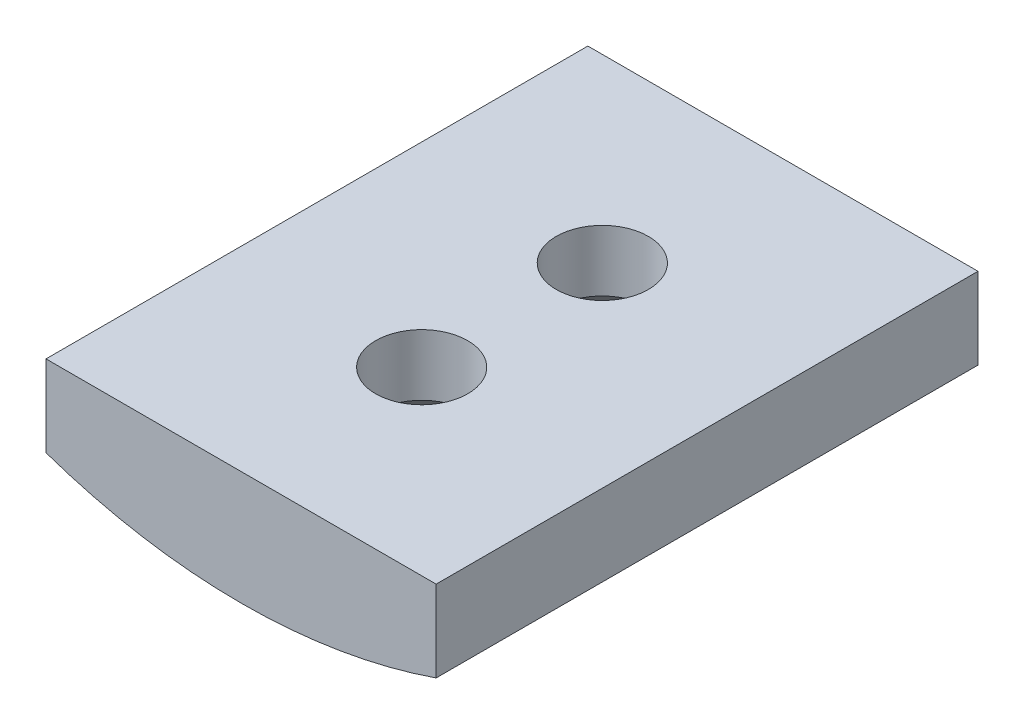
ISO-10303-21;
HEADER;
FILE_DESCRIPTION(('STEP AP214'),'2;1');
FILE_NAME('part.step','',(''),(''),'','','');
FILE_SCHEMA(('AUTOMOTIVE_DESIGN { 1 0 10303 214 1 1 1 1 }'));
ENDSEC;
DATA;
#1=APPLICATION_CONTEXT('core data for automotive mechanical design processes');
#2=APPLICATION_PROTOCOL_DEFINITION('international standard','automotive_design',2000,#1);
#3=PRODUCT_CONTEXT('',#1,'mechanical');
#4=PRODUCT('Part','Part','',(#3));
#5=PRODUCT_RELATED_PRODUCT_CATEGORY('part','',(#4));
#6=PRODUCT_DEFINITION_FORMATION('','',#4);
#7=PRODUCT_DEFINITION_CONTEXT('part definition',#1,'design');
#8=PRODUCT_DEFINITION('design','',#6,#7);
#9=PRODUCT_DEFINITION_SHAPE('','',#8);
#10=(LENGTH_UNIT() NAMED_UNIT(*) SI_UNIT(.MILLI.,.METRE.));
#11=(NAMED_UNIT(*) PLANE_ANGLE_UNIT() SI_UNIT($,.RADIAN.));
#12=(NAMED_UNIT(*) SI_UNIT($,.STERADIAN.) SOLID_ANGLE_UNIT());
#13=UNCERTAINTY_MEASURE_WITH_UNIT(LENGTH_MEASURE(1.E-05),#10,'distance_accuracy_value','');
#14=(GEOMETRIC_REPRESENTATION_CONTEXT(3) GLOBAL_UNCERTAINTY_ASSIGNED_CONTEXT((#13)) GLOBAL_UNIT_ASSIGNED_CONTEXT((#10,
#11,#12)) REPRESENTATION_CONTEXT('',''));
#15=CARTESIAN_POINT('',(0.,0.,0.));
#16=DIRECTION('',(0.,0.,1.));
#17=DIRECTION('',(1.,0.,0.));
#18=AXIS2_PLACEMENT_3D('',#15,#16,#17);
#19=CARTESIAN_POINT('',(7.2,0.,-20.));
#20=DIRECTION('',(1.,0.,0.));
#21=DIRECTION('',(0.,0.,-1.));
#22=AXIS2_PLACEMENT_3D('',#19,#20,#21);
#23=PLANE('',#22);
#24=DIRECTION('',(0.,1.,0.));
#25=VECTOR('',#24,1.);
#26=CARTESIAN_POINT('',(7.2,0.,0.));
#27=LINE('',#26,#25);
#28=CARTESIAN_POINT('',(7.2,-15.4,0.));
#29=VERTEX_POINT('',#28);
#30=CARTESIAN_POINT('',(7.2,-12.4,0.));
#31=VERTEX_POINT('',#30);
#32=EDGE_CURVE('E113',#29,#31,#27,.T.);
#33=ORIENTED_EDGE('',*,*,#32,.F.);
#34=DIRECTION('',(0.,0.,1.));
#35=VECTOR('',#34,1.);
#36=CARTESIAN_POINT('',(7.2,-15.4,-20.));
#37=LINE('',#36,#35);
#38=CARTESIAN_POINT('',(7.2,-15.4,-20.));
#39=VERTEX_POINT('',#38);
#40=EDGE_CURVE('E61',#39,#29,#37,.T.);
#41=ORIENTED_EDGE('',*,*,#40,.F.);
#42=DIRECTION('',(0.,1.,0.));
#43=VECTOR('',#42,1.);
#44=CARTESIAN_POINT('',(7.2,0.,-20.));
#45=LINE('',#44,#43);
#46=CARTESIAN_POINT('',(7.2,-12.4,-20.));
#47=VERTEX_POINT('',#46);
#48=EDGE_CURVE('E106',#39,#47,#45,.T.);
#49=ORIENTED_EDGE('',*,*,#48,.T.);
#50=DIRECTION('',(0.,0.,1.));
#51=VECTOR('',#50,1.);
#52=CARTESIAN_POINT('',(7.2,-12.4,-20.));
#53=LINE('',#52,#51);
#54=EDGE_CURVE('E89',#47,#31,#53,.T.);
#55=ORIENTED_EDGE('',*,*,#54,.T.);
#56=EDGE_LOOP('',(#33,#41,#49,#55));
#57=FACE_BOUND('',#56,.T.);
#58=ADVANCED_FACE('F40',(#57),#23,.T.);
#59=CARTESIAN_POINT('',(0.,5.45458957280147,-20.));
#60=DIRECTION('',(0.,0.,1.));
#61=DIRECTION('',(1.,0.,0.));
#62=AXIS2_PLACEMENT_3D('',#59,#60,#61);
#63=CYLINDRICAL_SURFACE('',#62,22.0625);
#64=CARTESIAN_POINT('',(3.15,-16.3818800651689,-13.3333333333333));
#65=CARTESIAN_POINT('',(3.1499926615335,-16.3818828935208,-13.1573666601596));
#66=CARTESIAN_POINT('',(3.13520528078202,-16.3840300759794,-12.9812954267399));
#67=CARTESIAN_POINT('',(3.07645819594805,-16.3923817871647,-12.6340687412061));
#68=CARTESIAN_POINT('',(3.03246941397847,-16.3985903600131,-12.4629183665483));
#69=CARTESIAN_POINT('',(2.9166563937715,-16.4143476338234,-12.1306100618841));
#70=CARTESIAN_POINT('',(2.84485275731884,-16.4238938621564,-11.9694448383609));
#71=CARTESIAN_POINT('',(2.67549551492006,-16.4452478824637,-11.6614756347439));
#72=CARTESIAN_POINT('',(2.57794571601529,-16.4570553400031,-11.5146695357861));
#73=CARTESIAN_POINT('',(2.35910786508147,-16.481697358379,-11.2384944528059));
#74=CARTESIAN_POINT('',(2.23766976590573,-16.4945380914667,-11.109244900656));
#75=CARTESIAN_POINT('',(1.9748262789637,-16.5197446266066,-10.8728858154427));
#76=CARTESIAN_POINT('',(1.83341982695304,-16.5321104033007,-10.7657774631791));
#77=CARTESIAN_POINT('',(1.53389253151385,-16.5550379410216,-10.5763039573934));
#78=CARTESIAN_POINT('',(1.37570178210913,-16.5655916361255,-10.4940482548667));
#79=CARTESIAN_POINT('',(1.04757468465851,-16.5836376799403,-10.3573169436052));
#80=CARTESIAN_POINT('',(0.877638900646125,-16.5911301755405,-10.3028400018981));
#81=CARTESIAN_POINT('',(0.532073437591138,-16.6021660936374,-10.2235732015948));
#82=CARTESIAN_POINT('',(0.356490412595248,-16.6057360607264,-10.1985837088388));
#83=CARTESIAN_POINT('',(0.0035893961119035,-16.6086155627789,-10.1783816507968));
#84=CARTESIAN_POINT('',(-0.173728507120744,-16.6079253133499,-10.1831675785913));
#85=CARTESIAN_POINT('',(-0.523705015637894,-16.602383445012,-10.2222222143901));
#86=CARTESIAN_POINT('',(-0.696388133389431,-16.5975621380731,-10.2562761714191));
#87=CARTESIAN_POINT('',(-1.03356346319494,-16.5843336916298,-10.3525635355542));
#88=CARTESIAN_POINT('',(-1.19805548069303,-16.5759264669977,-10.4147976116434));
#89=CARTESIAN_POINT('',(-1.51483383770857,-16.5564186234851,-10.5659010704175));
#90=CARTESIAN_POINT('',(-1.66707609491637,-16.545308809527,-10.654861633348));
#91=CARTESIAN_POINT('',(-1.95455259581068,-16.5216354602123,-10.8568263110571));
#92=CARTESIAN_POINT('',(-2.08978582308062,-16.5090718380658,-10.9698318616182));
#93=CARTESIAN_POINT('',(-2.34067011421858,-16.4837613511438,-11.2178770469077));
#94=CARTESIAN_POINT('',(-2.45613591360314,-16.4710138511737,-11.3531040809103));
#95=CARTESIAN_POINT('',(-2.66276310676184,-16.4468819437701,-11.6411147890806));
#96=CARTESIAN_POINT('',(-2.75392437627795,-16.4354975433058,-11.7938985530022));
#97=CARTESIAN_POINT('',(-2.90937533450732,-16.4153811427442,-12.1128702177329));
#98=CARTESIAN_POINT('',(-2.97364727607329,-16.4066508954423,-12.2790668851191));
#99=CARTESIAN_POINT('',(-3.07331557618337,-16.3928632054933,-12.6200477274304));
#100=CARTESIAN_POINT('',(-3.10871376972835,-16.387805529447,-12.7948313558835));
#101=CARTESIAN_POINT('',(-3.14937835779442,-16.3819794591579,-13.1463800470267));
#102=CARTESIAN_POINT('',(-3.15490679142086,-16.381173764918,-13.3231142028637));
#103=CARTESIAN_POINT('',(-3.13636903747217,-16.3838439740906,-13.6749863861285));
#104=CARTESIAN_POINT('',(-3.11230367911583,-16.387319757536,-13.8501244581402));
#105=CARTESIAN_POINT('',(-3.03548322562295,-16.398127098035,-14.1930293211403));
#106=CARTESIAN_POINT('',(-2.98285755131242,-16.4054412566249,-14.3608257021973));
#107=CARTESIAN_POINT('',(-2.85054450765458,-16.4230869617301,-14.6852149196855));
#108=CARTESIAN_POINT('',(-2.77085591832285,-16.4334186442712,-14.8418072506577));
#109=CARTESIAN_POINT('',(-2.58604503054297,-16.456023617457,-15.1405212898159));
#110=CARTESIAN_POINT('',(-2.48075242519724,-16.4683097104008,-15.2825366458558));
#111=CARTESIAN_POINT('',(-2.24796034810074,-16.4934001311382,-15.5469746621531));
#112=CARTESIAN_POINT('',(-2.12045974210801,-16.5062044853756,-15.6693963210774));
#113=CARTESIAN_POINT('',(-1.84571976158441,-16.5310046808898,-15.8921065892459));
#114=CARTESIAN_POINT('',(-1.69833927560974,-16.5429937244544,-15.9922219881573));
#115=CARTESIAN_POINT('',(-1.38870056952476,-16.5647080962977,-16.1662736083545));
#116=CARTESIAN_POINT('',(-1.22644272483405,-16.5744334816764,-16.2402104900078));
#117=CARTESIAN_POINT('',(-0.892206618222844,-16.5904948560094,-16.3595266581187));
#118=CARTESIAN_POINT('',(-0.720263324916976,-16.5968422698396,-16.4050022984199));
#119=CARTESIAN_POINT('',(-0.371084011993663,-16.6054803272357,-16.4664174649228));
#120=CARTESIAN_POINT('',(-0.193848308341552,-16.6077712124924,-16.4823587508045));
#121=CARTESIAN_POINT('',(0.159201399215112,-16.6080360665732,-16.4842128382914));
#122=CARTESIAN_POINT('',(0.335014037583778,-16.6060482246507,-16.4703912839983));
#123=CARTESIAN_POINT('',(0.681788752759662,-16.5980556302985,-16.4136793494021));
#124=CARTESIAN_POINT('',(0.852750840974787,-16.5920508873168,-16.3707890374712));
#125=CARTESIAN_POINT('',(1.1849101104499,-16.5766959939182,-16.2572480970433));
#126=CARTESIAN_POINT('',(1.34611309131084,-16.56734785368,-16.1866141465863));
#127=CARTESIAN_POINT('',(1.65442083179553,-16.546335483637,-16.0196189450328));
#128=CARTESIAN_POINT('',(1.80152522094758,-16.5346711929948,-15.9232570181287));
#129=CARTESIAN_POINT('',(2.07881068191738,-16.510200899173,-15.706573509054));
#130=CARTESIAN_POINT('',(2.20883728545014,-16.4973860345802,-15.5860552413913));
#131=CARTESIAN_POINT('',(2.44691946230842,-16.4721261645448,-15.3248933558101));
#132=CARTESIAN_POINT('',(2.55496986114982,-16.4596812467969,-15.1842450113452));
#133=CARTESIAN_POINT('',(2.74651764038748,-16.4365029300195,-14.8859831966027));
#134=CARTESIAN_POINT('',(2.82988796998625,-16.4257785132084,-14.72828745599));
#135=CARTESIAN_POINT('',(2.96883737310256,-16.4073606301906,-14.4010575291551));
#136=CARTESIAN_POINT('',(3.02444571551023,-16.3996639737022,-14.2315360264833));
#137=CARTESIAN_POINT('',(3.09345777676682,-16.3899793474276,-13.939902132076));
#138=CARTESIAN_POINT('',(3.11462927818026,-16.3869579150078,-13.8196035974595));
#139=CARTESIAN_POINT('',(3.14290285578349,-16.3829073043258,-13.5773312339388));
#140=CARTESIAN_POINT('',(3.15000508885963,-16.3818781038482,-13.4553574237309));
#141=CARTESIAN_POINT('',(3.15,-16.3818800651689,-13.3333333333333));
#142=B_SPLINE_CURVE_WITH_KNOTS('',3,(#64,#65,#66,#67,#68,#69,#70,#71,#72,#73,#74,#75,#76,#77,
#78,#79,#80,#81,#82,#83,#84,#85,#86,#87,#88,#89,#90,#91,#92,#93,#94,#95,#96,#97,#98,#99,#100,
#101,#102,#103,#104,#105,#106,#107,#108,#109,#110,#111,#112,#113,#114,#115,#116,#117,#118,#119,
#120,#121,#122,#123,#124,#125,#126,#127,#128,#129,#130,#131,#132,#133,#134,#135,#136,#137,#138,
#139,#140,#141),.UNSPECIFIED.,.T.,.F.,(4,2,2,2,2,2,2,2,2,2,2,2,2,2,2,2,2,2,2,2,2,2,2,2,2,2,2,2,
2,2,2,2,2,2,2,2,2,2,4),(0.,0.527454084039141,1.05543418060091,1.58302396060528,2.11053577046952,
2.64147335481299,3.17243924698673,3.70571052515762,4.23895621173451,4.7685706508212,
5.298158286599,5.82389298504149,6.34964016483893,6.87720175779943,7.40479486154192,
7.93709005528285,8.46938797035542,9.00203665369977,9.53465148321361,10.0625861516733,
10.5905060277278,11.1160533748039,11.641624416471,12.1707918452549,12.6999863084391,
13.2331569323469,13.766314105773,14.2976564024444,14.8289670403077,15.3555552063164,
15.8821421337507,16.4084129876709,16.9346976667331,17.4654555432717,17.9963382469533,
18.5299081702397,19.0629143675234,19.428681483444,19.7944445206745),.UNSPECIFIED.);
#143=CARTESIAN_POINT('',(3.15,-16.3818800651689,-13.3333333333333));
#144=VERTEX_POINT('',#143);
#145=EDGE_CURVE('E11',#144,#144,#142,.T.);
#146=ORIENTED_EDGE('',*,*,#145,.F.);
#147=EDGE_LOOP('',(#146));
#148=FACE_BOUND('',#147,.T.);
#149=CARTESIAN_POINT('',(3.15,-16.3818800651689,-6.66666666666667));
#150=CARTESIAN_POINT('',(3.1499926615335,-16.3818828935208,-6.49069999349292));
#151=CARTESIAN_POINT('',(3.13520528078202,-16.3840300759794,-6.31462876007321));
#152=CARTESIAN_POINT('',(3.07645819594805,-16.3923817871647,-5.9674020745394));
#153=CARTESIAN_POINT('',(3.03246941397847,-16.3985903600131,-5.79625169988163));
#154=CARTESIAN_POINT('',(2.9166563937715,-16.4143476338234,-5.4639433952174));
#155=CARTESIAN_POINT('',(2.84485275731884,-16.4238938621564,-5.30277817169419));
#156=CARTESIAN_POINT('',(2.67549551492006,-16.4452478824637,-4.99480896807727));
#157=CARTESIAN_POINT('',(2.57794571601529,-16.4570553400031,-4.84800286911941));
#158=CARTESIAN_POINT('',(2.35910786508147,-16.481697358379,-4.57182778613927));
#159=CARTESIAN_POINT('',(2.23766976590573,-16.4945380914667,-4.44257823398935));
#160=CARTESIAN_POINT('',(1.9748262789637,-16.5197446266066,-4.20621914877607));
#161=CARTESIAN_POINT('',(1.83341982695304,-16.5321104033007,-4.09911079651247));
#162=CARTESIAN_POINT('',(1.53389253151384,-16.5550379410216,-3.90963729072676));
#163=CARTESIAN_POINT('',(1.37570178210912,-16.5655916361255,-3.82738158820006));
#164=CARTESIAN_POINT('',(1.04757468465851,-16.5836376799403,-3.69065027693855));
#165=CARTESIAN_POINT('',(0.877638900646123,-16.5911301755405,-3.6361733352314));
#166=CARTESIAN_POINT('',(0.532073437591136,-16.6021660936374,-3.55690653492812));
#167=CARTESIAN_POINT('',(0.356490412595246,-16.6057360607264,-3.53191704217214));
#168=CARTESIAN_POINT('',(0.00358939611190193,-16.6086155627789,-3.51171498413013));
#169=CARTESIAN_POINT('',(-0.173728507120746,-16.6079253133499,-3.51650091192466));
#170=CARTESIAN_POINT('',(-0.523705015637896,-16.602383445012,-3.55555554772342));
#171=CARTESIAN_POINT('',(-0.696388133389433,-16.5975621380731,-3.5896095047524));
#172=CARTESIAN_POINT('',(-1.03356346319494,-16.5843336916298,-3.6858968688875));
#173=CARTESIAN_POINT('',(-1.19805548069304,-16.5759264669977,-3.74813094497672));
#174=CARTESIAN_POINT('',(-1.51483383770857,-16.5564186234851,-3.89923440375086));
#175=CARTESIAN_POINT('',(-1.66707609491637,-16.545308809527,-3.98819496668129));
#176=CARTESIAN_POINT('',(-1.95455259581068,-16.5216354602123,-4.19015964439038));
#177=CARTESIAN_POINT('',(-2.08978582308062,-16.5090718380658,-4.30316519495151));
#178=CARTESIAN_POINT('',(-2.34067011421858,-16.4837613511438,-4.55121038024106));
#179=CARTESIAN_POINT('',(-2.45613591360314,-16.4710138511737,-4.68643741424366));
#180=CARTESIAN_POINT('',(-2.66276310676184,-16.4468819437701,-4.97444812241393));
#181=CARTESIAN_POINT('',(-2.75392437627795,-16.4354975433058,-5.12723188633549));
#182=CARTESIAN_POINT('',(-2.90937533450732,-16.4153811427442,-5.44620355106628));
#183=CARTESIAN_POINT('',(-2.97364727607329,-16.4066508954423,-5.61240021845244));
#184=CARTESIAN_POINT('',(-3.07331557618337,-16.3928632054933,-5.95338106076377));
#185=CARTESIAN_POINT('',(-3.10871376972835,-16.387805529447,-6.12816468921688));
#186=CARTESIAN_POINT('',(-3.14937835779442,-16.3819794591579,-6.47971338036006));
#187=CARTESIAN_POINT('',(-3.15490679142086,-16.381173764918,-6.656447536197));
#188=CARTESIAN_POINT('',(-3.13636903747217,-16.3838439740906,-7.00831971946183));
#189=CARTESIAN_POINT('',(-3.11230367911583,-16.387319757536,-7.1834577914735));
#190=CARTESIAN_POINT('',(-3.03548322562295,-16.398127098035,-7.52636265447359));
#191=CARTESIAN_POINT('',(-2.98285755131242,-16.4054412566249,-7.69415903553065));
#192=CARTESIAN_POINT('',(-2.85054450765458,-16.4230869617301,-8.01854825301888));
#193=CARTESIAN_POINT('',(-2.77085591832285,-16.4334186442712,-8.17514058399099));
#194=CARTESIAN_POINT('',(-2.58604503054297,-16.456023617457,-8.47385462314928));
#195=CARTESIAN_POINT('',(-2.48075242519725,-16.4683097104008,-8.61586997918913));
#196=CARTESIAN_POINT('',(-2.24796034810074,-16.4934001311382,-8.88030799548648));
#197=CARTESIAN_POINT('',(-2.12045974210801,-16.5062044853756,-9.00272965441076));
#198=CARTESIAN_POINT('',(-1.84571976158441,-16.5310046808898,-9.22543992257924));
#199=CARTESIAN_POINT('',(-1.69833927560974,-16.5429937244544,-9.32555532149061));
#200=CARTESIAN_POINT('',(-1.38870056952476,-16.5647080962977,-9.49960694168779));
#201=CARTESIAN_POINT('',(-1.22644272483405,-16.5744334816764,-9.57354382334116));
#202=CARTESIAN_POINT('',(-0.892206618222844,-16.5904948560094,-9.692859991452));
#203=CARTESIAN_POINT('',(-0.720263324916976,-16.5968422698396,-9.73833563175322));
#204=CARTESIAN_POINT('',(-0.371084011993663,-16.6054803272357,-9.79975079825614));
#205=CARTESIAN_POINT('',(-0.193848308341552,-16.6077712124924,-9.81569208413779));
#206=CARTESIAN_POINT('',(0.159201399215111,-16.6080360665732,-9.81754617162473));
#207=CARTESIAN_POINT('',(0.335014037583778,-16.6060482246507,-9.80372461733161));
#208=CARTESIAN_POINT('',(0.681788752759661,-16.5980556302985,-9.74701268273548));
#209=CARTESIAN_POINT('',(0.852750840974787,-16.5920508873168,-9.70412237080456));
#210=CARTESIAN_POINT('',(1.18491011044989,-16.5766959939182,-9.59058143037663));
#211=CARTESIAN_POINT('',(1.34611309131084,-16.56734785368,-9.51994747991959));
#212=CARTESIAN_POINT('',(1.65442083179552,-16.546335483637,-9.35295227836618));
#213=CARTESIAN_POINT('',(1.80152522094757,-16.5346711929948,-9.25659035146205));
#214=CARTESIAN_POINT('',(2.07881068191738,-16.510200899173,-9.03990684238738));
#215=CARTESIAN_POINT('',(2.20883728545014,-16.4973860345802,-8.91938857472461));
#216=CARTESIAN_POINT('',(2.44691946230842,-16.4721261645448,-8.65822668914347));
#217=CARTESIAN_POINT('',(2.55496986114982,-16.4596812467969,-8.51757834467849));
#218=CARTESIAN_POINT('',(2.74651764038748,-16.4365029300195,-8.21931652993603));
#219=CARTESIAN_POINT('',(2.82988796998625,-16.4257785132084,-8.06162078932332));
#220=CARTESIAN_POINT('',(2.96883737310256,-16.4073606301906,-7.73439086248839));
#221=CARTESIAN_POINT('',(3.02444571551023,-16.3996639737022,-7.56486935981667));
#222=CARTESIAN_POINT('',(3.09345777676682,-16.3899793474276,-7.27323546540938));
#223=CARTESIAN_POINT('',(3.11462927818026,-16.3869579150078,-7.15293693079285));
#224=CARTESIAN_POINT('',(3.14290285578349,-16.3829073043258,-6.91066456727217));
#225=CARTESIAN_POINT('',(3.15000508885963,-16.3818781038482,-6.78869075706426));
#226=CARTESIAN_POINT('',(3.15,-16.3818800651689,-6.66666666666667));
#227=B_SPLINE_CURVE_WITH_KNOTS('',3,(#149,#150,#151,#152,#153,#154,#155,#156,#157,#158,#159,
#160,#161,#162,#163,#164,#165,#166,#167,#168,#169,#170,#171,#172,#173,#174,#175,#176,#177,#178,
#179,#180,#181,#182,#183,#184,#185,#186,#187,#188,#189,#190,#191,#192,#193,#194,#195,#196,#197,
#198,#199,#200,#201,#202,#203,#204,#205,#206,#207,#208,#209,#210,#211,#212,#213,#214,#215,#216,
#217,#218,#219,#220,#221,#222,#223,#224,#225,#226),.UNSPECIFIED.,.T.,.F.,(4,2,2,2,2,2,2,2,2,2,2,
2,2,2,2,2,2,2,2,2,2,2,2,2,2,2,2,2,2,2,2,2,2,2,2,2,2,2,4),(0.,0.527454084039142,1.05543418060092,
1.58302396060527,2.11053577046952,2.64147335481299,3.17243924698673,3.70571052515762,
4.23895621173451,4.7685706508212,5.298158286599,5.82389298504149,6.34964016483893,
6.87720175779942,7.40479486154192,7.93709005528285,8.46938797035542,9.00203665369976,
9.53465148321361,10.0625861516733,10.5905060277278,11.1160533748039,11.641624416471,
12.1707918452549,12.6999863084391,13.2331569323468,13.766314105773,14.2976564024444,
14.8289670403077,15.3555552063164,15.8821421337507,16.4084129876709,16.9346976667331,
17.4654555432717,17.9963382469533,18.5299081702397,19.0629143675234,19.428681483444,
19.7944445206745),.UNSPECIFIED.);
#228=CARTESIAN_POINT('',(3.15,-16.3818800651689,-6.66666666666667));
#229=VERTEX_POINT('',#228);
#230=EDGE_CURVE('E53',#229,#229,#227,.T.);
#231=ORIENTED_EDGE('',*,*,#230,.F.);
#232=EDGE_LOOP('',(#231));
#233=FACE_BOUND('',#232,.T.);
#234=CARTESIAN_POINT('',(0.,5.45458957280147,0.));
#235=DIRECTION('',(0.,0.,1.));
#236=DIRECTION('',(1.,0.,0.));
#237=AXIS2_PLACEMENT_3D('',#234,#235,#236);
#238=CIRCLE('',#237,22.0625);
#239=CARTESIAN_POINT('',(-7.2,-15.4,0.));
#240=VERTEX_POINT('',#239);
#241=EDGE_CURVE('E108',#240,#29,#238,.T.);
#242=ORIENTED_EDGE('',*,*,#241,.F.);
#243=DIRECTION('',(0.,0.,1.));
#244=VECTOR('',#243,1.);
#245=CARTESIAN_POINT('',(-7.2,-15.4,-20.));
#246=LINE('',#245,#244);
#247=CARTESIAN_POINT('',(-7.2,-15.4,-20.));
#248=VERTEX_POINT('',#247);
#249=EDGE_CURVE('E78',#248,#240,#246,.T.);
#250=ORIENTED_EDGE('',*,*,#249,.F.);
#251=CARTESIAN_POINT('',(0.,5.45458957280147,-20.));
#252=DIRECTION('',(0.,0.,1.));
#253=DIRECTION('',(1.,0.,0.));
#254=AXIS2_PLACEMENT_3D('',#251,#252,#253);
#255=CIRCLE('',#254,22.0625);
#256=EDGE_CURVE('E98',#248,#39,#255,.T.);
#257=ORIENTED_EDGE('',*,*,#256,.T.);
#258=ORIENTED_EDGE('',*,*,#40,.T.);
#259=EDGE_LOOP('',(#242,#250,#257,#258));
#260=FACE_BOUND('',#259,.T.);
#261=ADVANCED_FACE('F129',(#148,#233,#260),#63,.T.);
#262=CARTESIAN_POINT('',(-7.2,0.,-20.));
#263=DIRECTION('',(1.,0.,0.));
#264=DIRECTION('',(0.,0.,-1.));
#265=AXIS2_PLACEMENT_3D('',#262,#263,#264);
#266=PLANE('',#265);
#267=DIRECTION('',(0.,1.,0.));
#268=VECTOR('',#267,1.);
#269=CARTESIAN_POINT('',(-7.2,0.,0.));
#270=LINE('',#269,#268);
#271=CARTESIAN_POINT('',(-7.2,-12.4,0.));
#272=VERTEX_POINT('',#271);
#273=EDGE_CURVE('E102',#240,#272,#270,.T.);
#274=ORIENTED_EDGE('',*,*,#273,.T.);
#275=DIRECTION('',(0.,0.,1.));
#276=VECTOR('',#275,1.);
#277=CARTESIAN_POINT('',(-7.2,-12.4,-20.));
#278=LINE('',#277,#276);
#279=CARTESIAN_POINT('',(-7.2,-12.4,-20.));
#280=VERTEX_POINT('',#279);
#281=EDGE_CURVE('E100',#280,#272,#278,.T.);
#282=ORIENTED_EDGE('',*,*,#281,.F.);
#283=DIRECTION('',(0.,1.,0.));
#284=VECTOR('',#283,1.);
#285=CARTESIAN_POINT('',(-7.2,0.,-20.));
#286=LINE('',#285,#284);
#287=EDGE_CURVE('E94',#248,#280,#286,.T.);
#288=ORIENTED_EDGE('',*,*,#287,.F.);
#289=ORIENTED_EDGE('',*,*,#249,.T.);
#290=EDGE_LOOP('',(#274,#282,#288,#289));
#291=FACE_BOUND('',#290,.T.);
#292=ADVANCED_FACE('F101',(#291),#266,.F.);
#293=CARTESIAN_POINT('',(0.,-12.4,-20.));
#294=DIRECTION('',(0.,1.,0.));
#295=DIRECTION('',(0.,0.,1.));
#296=AXIS2_PLACEMENT_3D('',#293,#294,#295);
#297=PLANE('',#296);
#298=CARTESIAN_POINT('',(0.,-12.4,-6.66666666666667));
#299=DIRECTION('',(0.,-1.,0.));
#300=DIRECTION('',(0.,0.,-1.));
#301=AXIS2_PLACEMENT_3D('',#298,#299,#300);
#302=CIRCLE('',#301,1.7);
#303=CARTESIAN_POINT('',(0.,-12.4,-8.36666666666667));
#304=VERTEX_POINT('',#303);
#305=EDGE_CURVE('E166',#304,#304,#302,.T.);
#306=ORIENTED_EDGE('',*,*,#305,.T.);
#307=EDGE_LOOP('',(#306));
#308=FACE_BOUND('',#307,.T.);
#309=CARTESIAN_POINT('',(0.,-12.4,-13.3333333333333));
#310=DIRECTION('',(0.,-1.,0.));
#311=DIRECTION('',(0.,0.,-1.));
#312=AXIS2_PLACEMENT_3D('',#309,#310,#311);
#313=CIRCLE('',#312,1.7);
#314=CARTESIAN_POINT('',(0.,-12.4,-15.0333333333333));
#315=VERTEX_POINT('',#314);
#316=EDGE_CURVE('E117',#315,#315,#313,.T.);
#317=ORIENTED_EDGE('',*,*,#316,.T.);
#318=EDGE_LOOP('',(#317));
#319=FACE_BOUND('',#318,.T.);
#320=DIRECTION('',(-1.,0.,0.));
#321=VECTOR('',#320,1.);
#322=CARTESIAN_POINT('',(0.,-12.4,0.));
#323=LINE('',#322,#321);
#324=EDGE_CURVE('E116',#31,#272,#323,.T.);
#325=ORIENTED_EDGE('',*,*,#324,.F.);
#326=ORIENTED_EDGE('',*,*,#54,.F.);
#327=DIRECTION('',(-1.,0.,0.));
#328=VECTOR('',#327,1.);
#329=CARTESIAN_POINT('',(0.,-12.4,-20.));
#330=LINE('',#329,#328);
#331=EDGE_CURVE('E97',#47,#280,#330,.T.);
#332=ORIENTED_EDGE('',*,*,#331,.T.);
#333=ORIENTED_EDGE('',*,*,#281,.T.);
#334=EDGE_LOOP('',(#325,#326,#332,#333));
#335=FACE_BOUND('',#334,.T.);
#336=ADVANCED_FACE('F105',(#308,#319,#335),#297,.T.);
#337=CARTESIAN_POINT('',(0.,0.,-20.));
#338=DIRECTION('',(0.,0.,1.));
#339=DIRECTION('',(1.,0.,0.));
#340=AXIS2_PLACEMENT_3D('',#337,#338,#339);
#341=PLANE('',#340);
#342=ORIENTED_EDGE('',*,*,#48,.F.);
#343=ORIENTED_EDGE('',*,*,#256,.F.);
#344=ORIENTED_EDGE('',*,*,#287,.T.);
#345=ORIENTED_EDGE('',*,*,#331,.F.);
#346=EDGE_LOOP('',(#342,#343,#344,#345));
#347=FACE_BOUND('',#346,.T.);
#348=ADVANCED_FACE('F96',(#347),#341,.F.);
#349=CARTESIAN_POINT('',(0.,0.,0.));
#350=DIRECTION('',(0.,0.,1.));
#351=DIRECTION('',(1.,0.,0.));
#352=AXIS2_PLACEMENT_3D('',#349,#350,#351);
#353=PLANE('',#352);
#354=ORIENTED_EDGE('',*,*,#32,.T.);
#355=ORIENTED_EDGE('',*,*,#324,.T.);
#356=ORIENTED_EDGE('',*,*,#273,.F.);
#357=ORIENTED_EDGE('',*,*,#241,.T.);
#358=EDGE_LOOP('',(#354,#355,#356,#357));
#359=FACE_BOUND('',#358,.T.);
#360=ADVANCED_FACE('F138',(#359),#353,.T.);
#361=CARTESIAN_POINT('',(0.,-16.1079104271985,-6.66666666666667));
#362=DIRECTION('',(0.,-1.,0.));
#363=DIRECTION('',(1.,0.,0.));
#364=AXIS2_PLACEMENT_3D('',#361,#362,#363);
#365=CYLINDRICAL_SURFACE('',#364,3.15);
#366=ORIENTED_EDGE('',*,*,#230,.T.);
#367=EDGE_LOOP('',(#366));
#368=FACE_BOUND('',#367,.T.);
#369=CARTESIAN_POINT('',(0.,-16.1079104271985,-6.66666666666667));
#370=DIRECTION('',(0.,-1.,0.));
#371=DIRECTION('',(0.,0.,-1.));
#372=AXIS2_PLACEMENT_3D('',#369,#370,#371);
#373=CIRCLE('',#372,3.15);
#374=CARTESIAN_POINT('',(0.,-16.1079104271985,-9.81666666666667));
#375=VERTEX_POINT('',#374);
#376=EDGE_CURVE('E161',#375,#375,#373,.T.);
#377=ORIENTED_EDGE('',*,*,#376,.F.);
#378=EDGE_LOOP('',(#377));
#379=FACE_BOUND('',#378,.T.);
#380=ADVANCED_FACE('F133',(#368,#379),#365,.F.);
#381=CARTESIAN_POINT('',(0.,-16.1079104271985,-13.3333333333333));
#382=DIRECTION('',(0.,-1.,0.));
#383=DIRECTION('',(1.,0.,0.));
#384=AXIS2_PLACEMENT_3D('',#381,#382,#383);
#385=CYLINDRICAL_SURFACE('',#384,3.15);
#386=ORIENTED_EDGE('',*,*,#145,.T.);
#387=EDGE_LOOP('',(#386));
#388=FACE_BOUND('',#387,.T.);
#389=CARTESIAN_POINT('',(0.,-16.1079104271985,-13.3333333333333));
#390=DIRECTION('',(0.,-1.,0.));
#391=DIRECTION('',(0.,0.,-1.));
#392=AXIS2_PLACEMENT_3D('',#389,#390,#391);
#393=CIRCLE('',#392,3.15);
#394=CARTESIAN_POINT('',(0.,-16.1079104271985,-16.4833333333333));
#395=VERTEX_POINT('',#394);
#396=EDGE_CURVE('E171',#395,#395,#393,.T.);
#397=ORIENTED_EDGE('',*,*,#396,.F.);
#398=EDGE_LOOP('',(#397));
#399=FACE_BOUND('',#398,.T.);
#400=ADVANCED_FACE('F137',(#388,#399),#385,.F.);
#401=CARTESIAN_POINT('',(0.,-16.1079104271985,-13.3333333333333));
#402=DIRECTION('',(0.,-1.,0.));
#403=DIRECTION('',(0.,0.,-1.));
#404=AXIS2_PLACEMENT_3D('',#401,#402,#403);
#405=CYLINDRICAL_SURFACE('',#404,1.7);
#406=ORIENTED_EDGE('',*,*,#316,.F.);
#407=EDGE_LOOP('',(#406));
#408=FACE_BOUND('',#407,.T.);
#409=CARTESIAN_POINT('',(0.,-14.6579104271985,-13.3333333333333));
#410=DIRECTION('',(0.,-1.,0.));
#411=DIRECTION('',(0.,0.,-1.));
#412=AXIS2_PLACEMENT_3D('',#409,#410,#411);
#413=CIRCLE('',#412,1.7);
#414=CARTESIAN_POINT('',(0.,-14.6579104271985,-15.0333333333333));
#415=VERTEX_POINT('',#414);
#416=EDGE_CURVE('E174',#415,#415,#413,.T.);
#417=ORIENTED_EDGE('',*,*,#416,.T.);
#418=EDGE_LOOP('',(#417));
#419=FACE_BOUND('',#418,.T.);
#420=ADVANCED_FACE('F180',(#408,#419),#405,.F.);
#421=CARTESIAN_POINT('',(0.,-16.1079104271985,-13.3333333333333));
#422=DIRECTION('',(0.,-1.,0.));
#423=DIRECTION('',(0.,0.,-1.));
#424=AXIS2_PLACEMENT_3D('',#421,#422,#423);
#425=CONICAL_SURFACE('',#424,3.15,0.785398163397448);
#426=ORIENTED_EDGE('',*,*,#416,.F.);
#427=EDGE_LOOP('',(#426));
#428=FACE_BOUND('',#427,.T.);
#429=ORIENTED_EDGE('',*,*,#396,.T.);
#430=EDGE_LOOP('',(#429));
#431=FACE_BOUND('',#430,.T.);
#432=ADVANCED_FACE('F183',(#428,#431),#425,.F.);
#433=CARTESIAN_POINT('',(0.,-16.1079104271985,-6.66666666666667));
#434=DIRECTION('',(0.,-1.,0.));
#435=DIRECTION('',(0.,0.,-1.));
#436=AXIS2_PLACEMENT_3D('',#433,#434,#435);
#437=CYLINDRICAL_SURFACE('',#436,1.7);
#438=ORIENTED_EDGE('',*,*,#305,.F.);
#439=EDGE_LOOP('',(#438));
#440=FACE_BOUND('',#439,.T.);
#441=CARTESIAN_POINT('',(0.,-14.6579104271985,-6.66666666666667));
#442=DIRECTION('',(0.,-1.,0.));
#443=DIRECTION('',(0.,0.,-1.));
#444=AXIS2_PLACEMENT_3D('',#441,#442,#443);
#445=CIRCLE('',#444,1.7);
#446=CARTESIAN_POINT('',(0.,-14.6579104271985,-8.36666666666667));
#447=VERTEX_POINT('',#446);
#448=EDGE_CURVE('E163',#447,#447,#445,.T.);
#449=ORIENTED_EDGE('',*,*,#448,.T.);
#450=EDGE_LOOP('',(#449));
#451=FACE_BOUND('',#450,.T.);
#452=ADVANCED_FACE('F188',(#440,#451),#437,.F.);
#453=CARTESIAN_POINT('',(0.,-16.1079104271985,-6.66666666666667));
#454=DIRECTION('',(0.,-1.,0.));
#455=DIRECTION('',(0.,0.,-1.));
#456=AXIS2_PLACEMENT_3D('',#453,#454,#455);
#457=CONICAL_SURFACE('',#456,3.15,0.785398163397448);
#458=ORIENTED_EDGE('',*,*,#448,.F.);
#459=EDGE_LOOP('',(#458));
#460=FACE_BOUND('',#459,.T.);
#461=ORIENTED_EDGE('',*,*,#376,.T.);
#462=EDGE_LOOP('',(#461));
#463=FACE_BOUND('',#462,.T.);
#464=ADVANCED_FACE('F213',(#460,#463),#457,.F.);
#465=CLOSED_SHELL('',(#58,#261,#292,#336,#348,#360,#380,#400,#420,#432,#452,#464));
#466=MANIFOLD_SOLID_BREP('B2',#465);
#467=ADVANCED_BREP_SHAPE_REPRESENTATION('',(#18,#466),#14);
#468=SHAPE_DEFINITION_REPRESENTATION(#9,#467);
ENDSEC;
END-ISO-10303-21;
